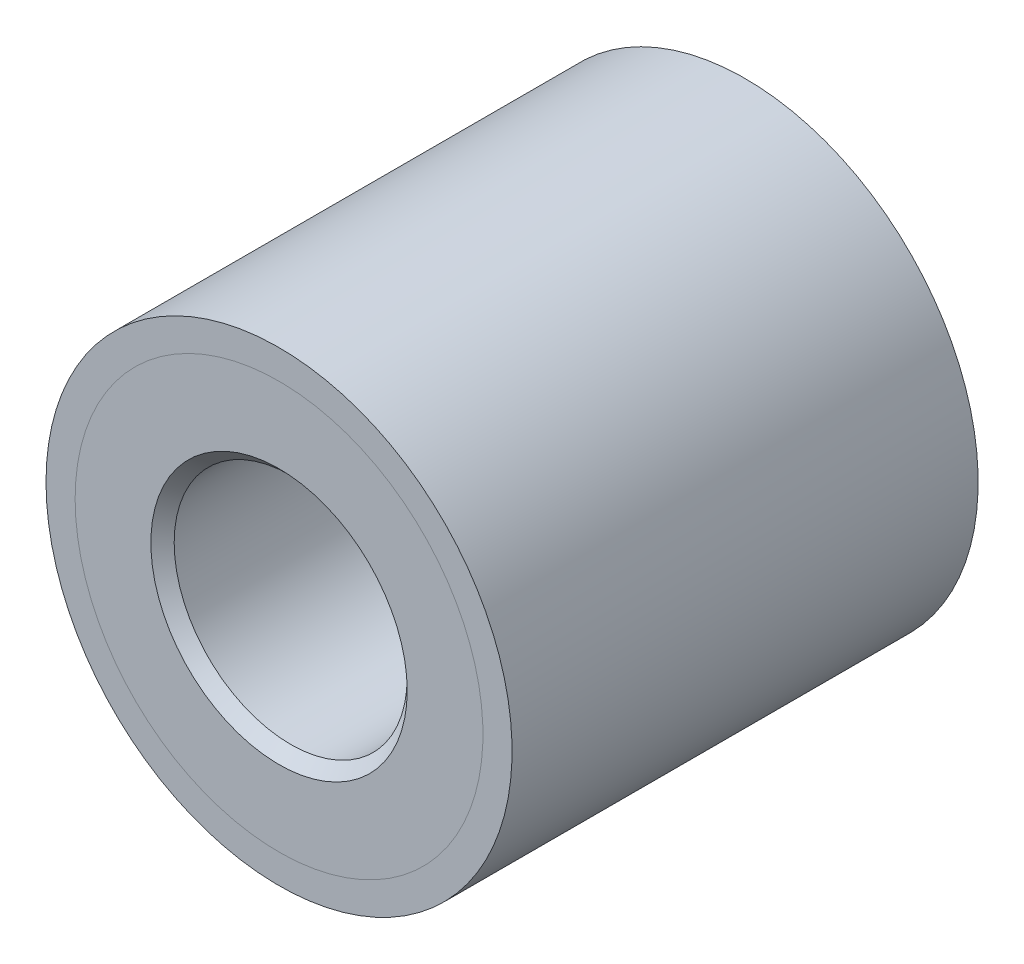
ISO-10303-21;
HEADER;
FILE_DESCRIPTION(('STEP AP214'),'2;1');
FILE_NAME('part.step','',(''),(''),'','','');
FILE_SCHEMA(('AUTOMOTIVE_DESIGN { 1 0 10303 214 1 1 1 1 }'));
ENDSEC;
DATA;
#1=APPLICATION_CONTEXT('core data for automotive mechanical design processes');
#2=APPLICATION_PROTOCOL_DEFINITION('international standard','automotive_design',2000,#1);
#3=PRODUCT_CONTEXT('',#1,'mechanical');
#4=PRODUCT('Part','Part','',(#3));
#5=PRODUCT_RELATED_PRODUCT_CATEGORY('part','',(#4));
#6=PRODUCT_DEFINITION_FORMATION('','',#4);
#7=PRODUCT_DEFINITION_CONTEXT('part definition',#1,'design');
#8=PRODUCT_DEFINITION('design','',#6,#7);
#9=PRODUCT_DEFINITION_SHAPE('','',#8);
#10=(LENGTH_UNIT() NAMED_UNIT(*) SI_UNIT(.MILLI.,.METRE.));
#11=(NAMED_UNIT(*) PLANE_ANGLE_UNIT() SI_UNIT($,.RADIAN.));
#12=(NAMED_UNIT(*) SI_UNIT($,.STERADIAN.) SOLID_ANGLE_UNIT());
#13=UNCERTAINTY_MEASURE_WITH_UNIT(LENGTH_MEASURE(1.E-05),#10,'distance_accuracy_value','');
#14=(GEOMETRIC_REPRESENTATION_CONTEXT(3) GLOBAL_UNCERTAINTY_ASSIGNED_CONTEXT((#13)) GLOBAL_UNIT_ASSIGNED_CONTEXT((#10,
#11,#12)) REPRESENTATION_CONTEXT('',''));
#15=CARTESIAN_POINT('',(0.,0.,0.));
#16=DIRECTION('',(0.,0.,1.));
#17=DIRECTION('',(1.,0.,0.));
#18=AXIS2_PLACEMENT_3D('',#15,#16,#17);
#19=CARTESIAN_POINT('',(0.,0.,12.7));
#20=DIRECTION('',(0.,0.,-1.));
#21=DIRECTION('',(-1.,0.,0.));
#22=AXIS2_PLACEMENT_3D('',#19,#20,#21);
#23=CYLINDRICAL_SURFACE('',#22,11.1125);
#24=CARTESIAN_POINT('',(0.,0.,-12.7));
#25=DIRECTION('',(0.,0.,-1.));
#26=DIRECTION('',(-1.,0.,0.));
#27=AXIS2_PLACEMENT_3D('',#24,#25,#26);
#28=CIRCLE('',#27,11.1125);
#29=CARTESIAN_POINT('',(-11.1125,0.,-12.7));
#30=VERTEX_POINT('',#29);
#31=EDGE_CURVE('P0_E32',#30,#30,#28,.T.);
#32=ORIENTED_EDGE('',*,*,#31,.T.);
#33=EDGE_LOOP('',(#32));
#34=FACE_BOUND('',#33,.T.);
#35=CARTESIAN_POINT('',(0.,0.,12.7));
#36=DIRECTION('',(0.,0.,-1.));
#37=DIRECTION('',(-1.,0.,0.));
#38=AXIS2_PLACEMENT_3D('',#35,#36,#37);
#39=CIRCLE('',#38,11.1125);
#40=CARTESIAN_POINT('',(-11.1125,0.,12.7));
#41=VERTEX_POINT('',#40);
#42=EDGE_CURVE('P0_E18',#41,#41,#39,.T.);
#43=ORIENTED_EDGE('',*,*,#42,.F.);
#44=EDGE_LOOP('',(#43));
#45=FACE_BOUND('',#44,.T.);
#46=ADVANCED_FACE('P0_F15',(#34,#45),#23,.F.);
#47=CARTESIAN_POINT('',(0.,0.,12.7));
#48=DIRECTION('',(0.,0.,1.));
#49=DIRECTION('',(1.,0.,0.));
#50=AXIS2_PLACEMENT_3D('',#47,#48,#49);
#51=PLANE('',#50);
#52=ORIENTED_EDGE('',*,*,#42,.T.);
#53=EDGE_LOOP('',(#52));
#54=FACE_BOUND('',#53,.T.);
#55=CARTESIAN_POINT('',(0.,0.,12.7));
#56=DIRECTION('',(0.,0.,-1.));
#57=DIRECTION('',(-1.,0.,0.));
#58=AXIS2_PLACEMENT_3D('',#55,#56,#57);
#59=CIRCLE('',#58,12.7);
#60=CARTESIAN_POINT('',(-12.7,0.,12.7));
#61=VERTEX_POINT('',#60);
#62=EDGE_CURVE('P0_E23',#61,#61,#59,.T.);
#63=ORIENTED_EDGE('',*,*,#62,.F.);
#64=EDGE_LOOP('',(#63));
#65=FACE_BOUND('',#64,.T.);
#66=ADVANCED_FACE('P0_F43',(#54,#65),#51,.T.);
#67=CARTESIAN_POINT('',(0.,0.,-12.7));
#68=DIRECTION('',(0.,0.,1.));
#69=DIRECTION('',(1.,0.,0.));
#70=AXIS2_PLACEMENT_3D('',#67,#68,#69);
#71=PLANE('',#70);
#72=ORIENTED_EDGE('',*,*,#31,.F.);
#73=EDGE_LOOP('',(#72));
#74=FACE_BOUND('',#73,.T.);
#75=CARTESIAN_POINT('',(0.,0.,-12.7));
#76=DIRECTION('',(0.,0.,-1.));
#77=DIRECTION('',(-1.,0.,0.));
#78=AXIS2_PLACEMENT_3D('',#75,#76,#77);
#79=CIRCLE('',#78,12.7);
#80=CARTESIAN_POINT('',(-12.7,0.,-12.7));
#81=VERTEX_POINT('',#80);
#82=EDGE_CURVE('P0_E10',#81,#81,#79,.F.);
#83=ORIENTED_EDGE('',*,*,#82,.F.);
#84=EDGE_LOOP('',(#83));
#85=FACE_BOUND('',#84,.T.);
#86=ADVANCED_FACE('P0_F51',(#74,#85),#71,.F.);
#87=CARTESIAN_POINT('',(0.,0.,12.7));
#88=DIRECTION('',(0.,0.,-1.));
#89=DIRECTION('',(-1.,0.,0.));
#90=AXIS2_PLACEMENT_3D('',#87,#88,#89);
#91=CYLINDRICAL_SURFACE('',#90,12.7);
#92=ORIENTED_EDGE('',*,*,#82,.T.);
#93=EDGE_LOOP('',(#92));
#94=FACE_BOUND('',#93,.T.);
#95=ORIENTED_EDGE('',*,*,#62,.T.);
#96=EDGE_LOOP('',(#95));
#97=FACE_BOUND('',#96,.T.);
#98=ADVANCED_FACE('P0_F52',(#94,#97),#91,.T.);
#99=CLOSED_SHELL('',(#46,#66,#86,#98));
#100=MANIFOLD_SOLID_BREP('P0_B1',#99);
#101=CARTESIAN_POINT('',(0.,0.,12.7));
#102=DIRECTION('',(0.,0.,-1.));
#103=DIRECTION('',(-1.,0.,0.));
#104=AXIS2_PLACEMENT_3D('',#101,#102,#103);
#105=CYLINDRICAL_SURFACE('',#104,6.35);
#106=CARTESIAN_POINT('',(0.,0.,-12.0650000000069));
#107=DIRECTION('',(0.,0.,-1.));
#108=DIRECTION('',(-1.,0.,0.));
#109=AXIS2_PLACEMENT_3D('',#106,#107,#108);
#110=CIRCLE('',#109,6.34999999999764);
#111=CARTESIAN_POINT('',(-6.34999999999764,0.,-12.0650000000069));
#112=VERTEX_POINT('',#111);
#113=EDGE_CURVE('P1_E46',#112,#112,#110,.T.);
#114=ORIENTED_EDGE('',*,*,#113,.T.);
#115=EDGE_LOOP('',(#114));
#116=FACE_BOUND('',#115,.T.);
#117=CARTESIAN_POINT('',(0.,0.,12.0650000000069));
#118=DIRECTION('',(0.,0.,1.));
#119=DIRECTION('',(1.,0.,0.));
#120=AXIS2_PLACEMENT_3D('',#117,#118,#119);
#121=CIRCLE('',#120,6.35000000005448);
#122=CARTESIAN_POINT('',(6.35000000005448,0.,12.0650000000069));
#123=VERTEX_POINT('',#122);
#124=EDGE_CURVE('P1_E36',#123,#123,#121,.T.);
#125=ORIENTED_EDGE('',*,*,#124,.T.);
#126=EDGE_LOOP('',(#125));
#127=FACE_BOUND('',#126,.T.);
#128=ADVANCED_FACE('P1_F16',(#116,#127),#105,.F.);
#129=CARTESIAN_POINT('',(0.,0.,12.6999999999953));
#130=DIRECTION('',(0.,0.,1.));
#131=DIRECTION('',(1.,0.,0.));
#132=AXIS2_PLACEMENT_3D('',#129,#130,#131);
#133=CONICAL_SURFACE('',#132,6.98499999998603,0.785398163397448);
#134=ORIENTED_EDGE('',*,*,#124,.F.);
#135=EDGE_LOOP('',(#134));
#136=FACE_BOUND('',#135,.T.);
#137=CARTESIAN_POINT('',(0.,0.,12.6999999999953));
#138=DIRECTION('',(0.,0.,1.));
#139=DIRECTION('',(1.,0.,0.));
#140=AXIS2_PLACEMENT_3D('',#137,#138,#139);
#141=CIRCLE('',#140,6.98499999998603);
#142=CARTESIAN_POINT('',(6.98499999998603,0.,12.6999999999953));
#143=VERTEX_POINT('',#142);
#144=EDGE_CURVE('P1_E19',#143,#143,#141,.F.);
#145=ORIENTED_EDGE('',*,*,#144,.F.);
#146=EDGE_LOOP('',(#145));
#147=FACE_BOUND('',#146,.T.);
#148=ADVANCED_FACE('P1_F59',(#136,#147),#133,.F.);
#149=CARTESIAN_POINT('',(0.,0.,-12.6999999999953));
#150=DIRECTION('',(0.,0.,-1.));
#151=DIRECTION('',(-1.,0.,0.));
#152=AXIS2_PLACEMENT_3D('',#149,#150,#151);
#153=CONICAL_SURFACE('',#152,6.98499999998603,0.785398163397448);
#154=CARTESIAN_POINT('',(0.,0.,-12.6999999999953));
#155=DIRECTION('',(0.,0.,-1.));
#156=DIRECTION('',(-1.,0.,0.));
#157=AXIS2_PLACEMENT_3D('',#154,#155,#156);
#158=CIRCLE('',#157,6.98499999998603);
#159=CARTESIAN_POINT('',(-6.98499999998603,0.,-12.6999999999953));
#160=VERTEX_POINT('',#159);
#161=EDGE_CURVE('P1_E33',#160,#160,#158,.T.);
#162=ORIENTED_EDGE('',*,*,#161,.T.);
#163=EDGE_LOOP('',(#162));
#164=FACE_BOUND('',#163,.T.);
#165=ORIENTED_EDGE('',*,*,#113,.F.);
#166=EDGE_LOOP('',(#165));
#167=FACE_BOUND('',#166,.T.);
#168=ADVANCED_FACE('P1_F62',(#164,#167),#153,.F.);
#169=CARTESIAN_POINT('',(0.,0.,12.7));
#170=DIRECTION('',(0.,0.,1.));
#171=DIRECTION('',(1.,0.,0.));
#172=AXIS2_PLACEMENT_3D('',#169,#170,#171);
#173=PLANE('',#172);
#174=CARTESIAN_POINT('',(0.,0.,12.7));
#175=DIRECTION('',(0.,0.,-1.));
#176=DIRECTION('',(-1.,0.,0.));
#177=AXIS2_PLACEMENT_3D('',#174,#175,#176);
#178=CIRCLE('',#177,11.1125);
#179=CARTESIAN_POINT('',(-11.1125,0.,12.7));
#180=VERTEX_POINT('',#179);
#181=EDGE_CURVE('P1_E24',#180,#180,#178,.T.);
#182=ORIENTED_EDGE('',*,*,#181,.F.);
#183=EDGE_LOOP('',(#182));
#184=FACE_BOUND('',#183,.T.);
#185=ORIENTED_EDGE('',*,*,#144,.T.);
#186=EDGE_LOOP('',(#185));
#187=FACE_BOUND('',#186,.T.);
#188=ADVANCED_FACE('P1_F68',(#184,#187),#173,.T.);
#189=CARTESIAN_POINT('',(0.,0.,-12.7));
#190=DIRECTION('',(0.,0.,1.));
#191=DIRECTION('',(1.,0.,0.));
#192=AXIS2_PLACEMENT_3D('',#189,#190,#191);
#193=PLANE('',#192);
#194=CARTESIAN_POINT('',(0.,0.,-12.7));
#195=DIRECTION('',(0.,0.,-1.));
#196=DIRECTION('',(-1.,0.,0.));
#197=AXIS2_PLACEMENT_3D('',#194,#195,#196);
#198=CIRCLE('',#197,11.1125);
#199=CARTESIAN_POINT('',(-11.1125,0.,-12.7));
#200=VERTEX_POINT('',#199);
#201=EDGE_CURVE('P1_E10',#200,#200,#198,.F.);
#202=ORIENTED_EDGE('',*,*,#201,.F.);
#203=EDGE_LOOP('',(#202));
#204=FACE_BOUND('',#203,.T.);
#205=ORIENTED_EDGE('',*,*,#161,.F.);
#206=EDGE_LOOP('',(#205));
#207=FACE_BOUND('',#206,.T.);
#208=ADVANCED_FACE('P1_F72',(#204,#207),#193,.F.);
#209=CARTESIAN_POINT('',(0.,0.,12.7));
#210=DIRECTION('',(0.,0.,-1.));
#211=DIRECTION('',(-1.,0.,0.));
#212=AXIS2_PLACEMENT_3D('',#209,#210,#211);
#213=CYLINDRICAL_SURFACE('',#212,11.1125);
#214=ORIENTED_EDGE('',*,*,#201,.T.);
#215=EDGE_LOOP('',(#214));
#216=FACE_BOUND('',#215,.T.);
#217=ORIENTED_EDGE('',*,*,#181,.T.);
#218=EDGE_LOOP('',(#217));
#219=FACE_BOUND('',#218,.T.);
#220=ADVANCED_FACE('P1_F70',(#216,#219),#213,.T.);
#221=CLOSED_SHELL('',(#128,#148,#168,#188,#208,#220));
#222=MANIFOLD_SOLID_BREP('P1_B1',#221);
#223=ADVANCED_BREP_SHAPE_REPRESENTATION('',(#18,#100,#222),#14);
#224=SHAPE_DEFINITION_REPRESENTATION(#9,#223);
ENDSEC;
END-ISO-10303-21;
